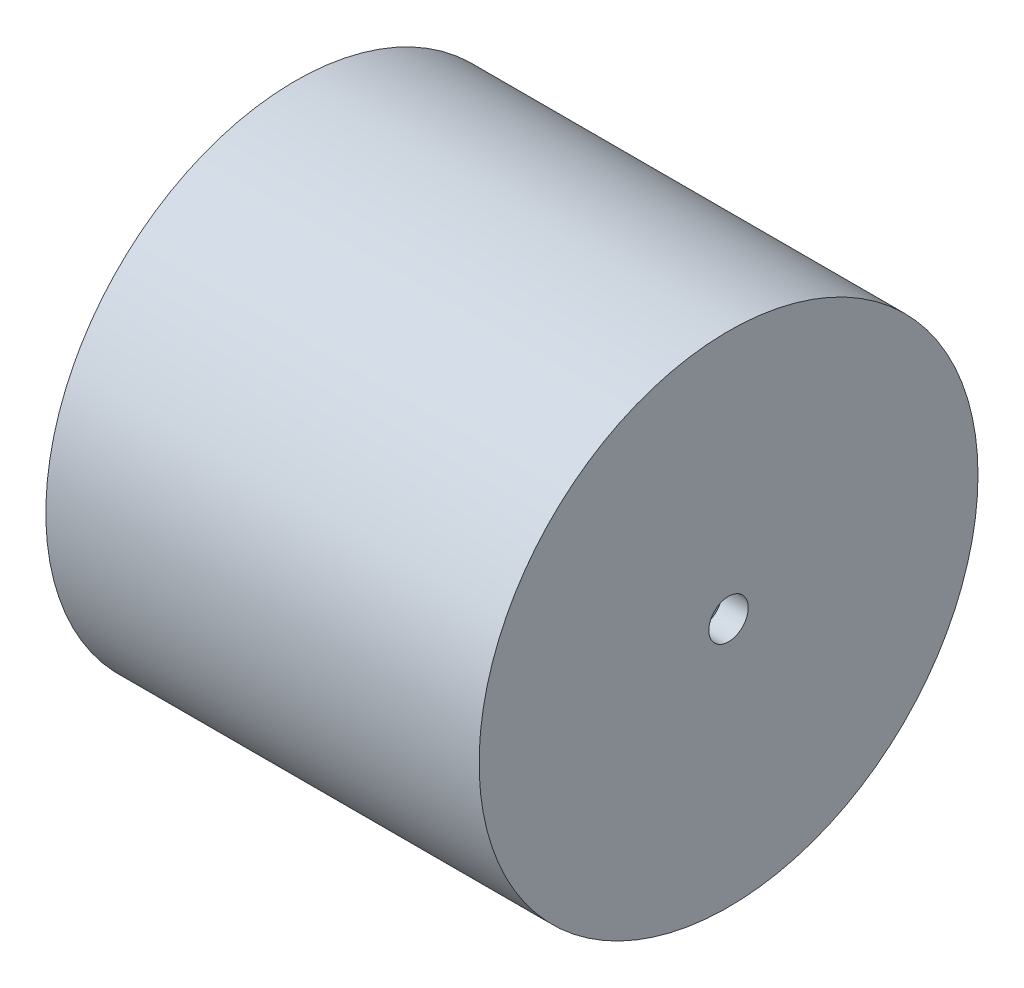
ISO-10303-21;
HEADER;
FILE_DESCRIPTION(('STEP AP214'),'2;1');
FILE_NAME('part.step','',(''),(''),'','','');
FILE_SCHEMA(('AUTOMOTIVE_DESIGN { 1 0 10303 214 1 1 1 1 }'));
ENDSEC;
DATA;
#1=APPLICATION_CONTEXT('core data for automotive mechanical design processes');
#2=APPLICATION_PROTOCOL_DEFINITION('international standard','automotive_design',2000,#1);
#3=PRODUCT_CONTEXT('',#1,'mechanical');
#4=PRODUCT('Part','Part','',(#3));
#5=PRODUCT_RELATED_PRODUCT_CATEGORY('part','',(#4));
#6=PRODUCT_DEFINITION_FORMATION('','',#4);
#7=PRODUCT_DEFINITION_CONTEXT('part definition',#1,'design');
#8=PRODUCT_DEFINITION('design','',#6,#7);
#9=PRODUCT_DEFINITION_SHAPE('','',#8);
#10=(LENGTH_UNIT() NAMED_UNIT(*) SI_UNIT(.MILLI.,.METRE.));
#11=(NAMED_UNIT(*) PLANE_ANGLE_UNIT() SI_UNIT($,.RADIAN.));
#12=(NAMED_UNIT(*) SI_UNIT($,.STERADIAN.) SOLID_ANGLE_UNIT());
#13=UNCERTAINTY_MEASURE_WITH_UNIT(LENGTH_MEASURE(1.E-05),#10,'distance_accuracy_value','');
#14=(GEOMETRIC_REPRESENTATION_CONTEXT(3) GLOBAL_UNCERTAINTY_ASSIGNED_CONTEXT((#13)) GLOBAL_UNIT_ASSIGNED_CONTEXT((#10,
#11,#12)) REPRESENTATION_CONTEXT('',''));
#15=CARTESIAN_POINT('',(0.,0.,0.));
#16=DIRECTION('',(0.,0.,1.));
#17=DIRECTION('',(1.,0.,0.));
#18=AXIS2_PLACEMENT_3D('',#15,#16,#17);
#19=CARTESIAN_POINT('',(33.,0.,0.));
#20=DIRECTION('',(-1.,0.,0.));
#21=DIRECTION('',(0.,0.,1.));
#22=AXIS2_PLACEMENT_3D('',#19,#20,#21);
#23=CYLINDRICAL_SURFACE('',#22,19.);
#24=CARTESIAN_POINT('',(33.,0.,0.));
#25=DIRECTION('',(1.,0.,0.));
#26=DIRECTION('',(0.,0.,-1.));
#27=AXIS2_PLACEMENT_3D('',#24,#25,#26);
#28=CIRCLE('',#27,19.);
#29=CARTESIAN_POINT('',(33.,0.,-19.));
#30=VERTEX_POINT('',#29);
#31=EDGE_CURVE('E10',#30,#30,#28,.T.);
#32=ORIENTED_EDGE('',*,*,#31,.F.);
#33=EDGE_LOOP('',(#32));
#34=FACE_BOUND('',#33,.T.);
#35=CARTESIAN_POINT('',(0.,0.,0.));
#36=DIRECTION('',(1.,0.,0.));
#37=DIRECTION('',(0.,0.,-1.));
#38=AXIS2_PLACEMENT_3D('',#35,#36,#37);
#39=CIRCLE('',#38,19.);
#40=CARTESIAN_POINT('',(0.,0.,-19.));
#41=VERTEX_POINT('',#40);
#42=EDGE_CURVE('E36',#41,#41,#39,.T.);
#43=ORIENTED_EDGE('',*,*,#42,.T.);
#44=EDGE_LOOP('',(#43));
#45=FACE_BOUND('',#44,.T.);
#46=ADVANCED_FACE('F33',(#34,#45),#23,.T.);
#47=CARTESIAN_POINT('',(33.,0.,0.));
#48=DIRECTION('',(1.,0.,0.));
#49=DIRECTION('',(0.,0.,-1.));
#50=AXIS2_PLACEMENT_3D('',#47,#48,#49);
#51=PLANE('',#50);
#52=CARTESIAN_POINT('',(33.,0.,0.));
#53=DIRECTION('',(1.,0.,0.));
#54=DIRECTION('',(0.,0.,-1.));
#55=AXIS2_PLACEMENT_3D('',#52,#53,#54);
#56=CIRCLE('',#55,1.5);
#57=CARTESIAN_POINT('',(33.,0.,-1.5));
#58=VERTEX_POINT('',#57);
#59=EDGE_CURVE('E45',#58,#58,#56,.T.);
#60=ORIENTED_EDGE('',*,*,#59,.F.);
#61=EDGE_LOOP('',(#60));
#62=FACE_BOUND('',#61,.T.);
#63=ORIENTED_EDGE('',*,*,#31,.T.);
#64=EDGE_LOOP('',(#63));
#65=FACE_BOUND('',#64,.T.);
#66=ADVANCED_FACE('F60',(#62,#65),#51,.T.);
#67=CARTESIAN_POINT('',(0.,0.,0.));
#68=DIRECTION('',(1.,0.,0.));
#69=DIRECTION('',(0.,0.,-1.));
#70=AXIS2_PLACEMENT_3D('',#67,#68,#69);
#71=PLANE('',#70);
#72=ORIENTED_EDGE('',*,*,#42,.F.);
#73=EDGE_LOOP('',(#72));
#74=FACE_BOUND('',#73,.T.);
#75=ADVANCED_FACE('F56',(#74),#71,.F.);
#76=CARTESIAN_POINT('',(31.,0.,0.));
#77=DIRECTION('',(1.,0.,0.));
#78=DIRECTION('',(0.,0.,-1.));
#79=AXIS2_PLACEMENT_3D('',#76,#77,#78);
#80=CYLINDRICAL_SURFACE('',#79,1.5);
#81=CARTESIAN_POINT('',(31.,0.,0.));
#82=DIRECTION('',(1.,0.,0.));
#83=DIRECTION('',(0.,0.,-1.));
#84=AXIS2_PLACEMENT_3D('',#81,#82,#83);
#85=CIRCLE('',#84,1.5);
#86=CARTESIAN_POINT('',(31.,0.,-1.5));
#87=VERTEX_POINT('',#86);
#88=EDGE_CURVE('E43',#87,#87,#85,.T.);
#89=ORIENTED_EDGE('',*,*,#88,.F.);
#90=EDGE_LOOP('',(#89));
#91=FACE_BOUND('',#90,.T.);
#92=ORIENTED_EDGE('',*,*,#59,.T.);
#93=EDGE_LOOP('',(#92));
#94=FACE_BOUND('',#93,.T.);
#95=ADVANCED_FACE('F53',(#91,#94),#80,.F.);
#96=CARTESIAN_POINT('',(31.,0.,0.));
#97=DIRECTION('',(1.,0.,0.));
#98=DIRECTION('',(0.,0.,-1.));
#99=AXIS2_PLACEMENT_3D('',#96,#97,#98);
#100=PLANE('',#99);
#101=ORIENTED_EDGE('',*,*,#88,.T.);
#102=EDGE_LOOP('',(#101));
#103=FACE_BOUND('',#102,.T.);
#104=ADVANCED_FACE('F51',(#103),#100,.T.);
#105=CLOSED_SHELL('',(#46,#66,#75,#95,#104));
#106=MANIFOLD_SOLID_BREP('B2',#105);
#107=ADVANCED_BREP_SHAPE_REPRESENTATION('',(#18,#106),#14);
#108=SHAPE_DEFINITION_REPRESENTATION(#9,#107);
ENDSEC;
END-ISO-10303-21;
